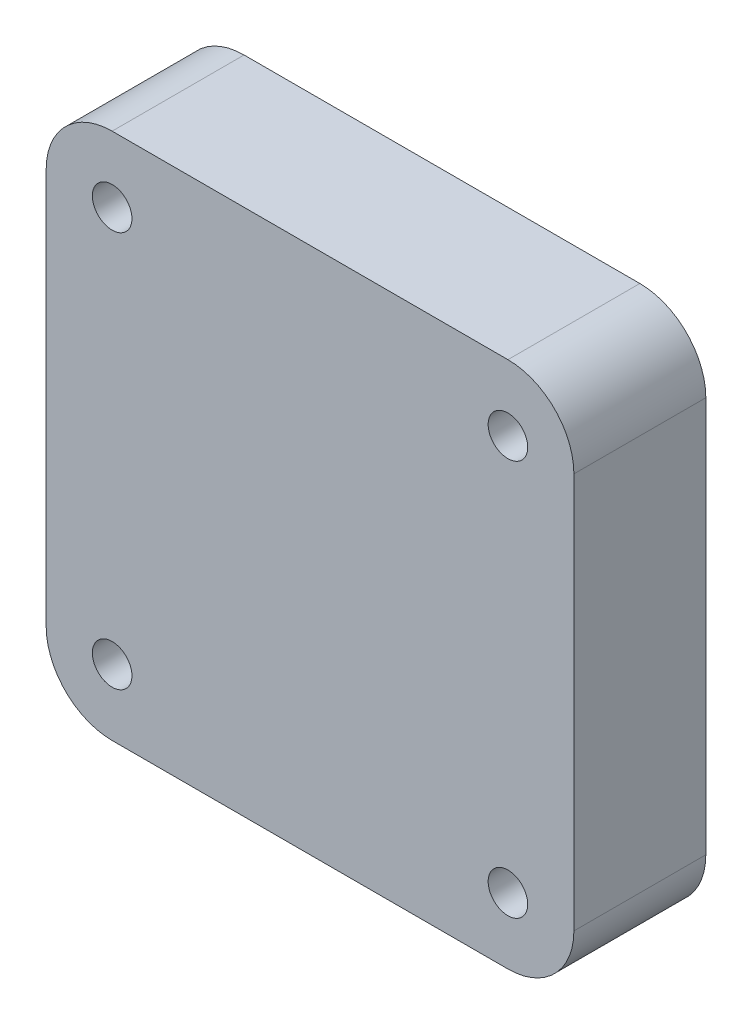
ISO-10303-21;
HEADER;
FILE_DESCRIPTION(('STEP AP214'),'2;1');
FILE_NAME('part.step','',(''),(''),'','','');
FILE_SCHEMA(('AUTOMOTIVE_DESIGN { 1 0 10303 214 1 1 1 1 }'));
ENDSEC;
DATA;
#1=APPLICATION_CONTEXT('core data for automotive mechanical design processes');
#2=APPLICATION_PROTOCOL_DEFINITION('international standard','automotive_design',2000,#1);
#3=PRODUCT_CONTEXT('',#1,'mechanical');
#4=PRODUCT('Part','Part','',(#3));
#5=PRODUCT_RELATED_PRODUCT_CATEGORY('part','',(#4));
#6=PRODUCT_DEFINITION_FORMATION('','',#4);
#7=PRODUCT_DEFINITION_CONTEXT('part definition',#1,'design');
#8=PRODUCT_DEFINITION('design','',#6,#7);
#9=PRODUCT_DEFINITION_SHAPE('','',#8);
#10=(LENGTH_UNIT() NAMED_UNIT(*) SI_UNIT(.MILLI.,.METRE.));
#11=(NAMED_UNIT(*) PLANE_ANGLE_UNIT() SI_UNIT($,.RADIAN.));
#12=(NAMED_UNIT(*) SI_UNIT($,.STERADIAN.) SOLID_ANGLE_UNIT());
#13=UNCERTAINTY_MEASURE_WITH_UNIT(LENGTH_MEASURE(1.E-05),#10,'distance_accuracy_value','');
#14=(GEOMETRIC_REPRESENTATION_CONTEXT(3) GLOBAL_UNCERTAINTY_ASSIGNED_CONTEXT((#13)) GLOBAL_UNIT_ASSIGNED_CONTEXT((#10,
#11,#12)) REPRESENTATION_CONTEXT('',''));
#15=CARTESIAN_POINT('',(0.,0.,0.));
#16=DIRECTION('',(0.,0.,1.));
#17=DIRECTION('',(1.,0.,0.));
#18=AXIS2_PLACEMENT_3D('',#15,#16,#17);
#19=CARTESIAN_POINT('',(0.,0.,10.));
#20=DIRECTION('',(0.,0.,1.));
#21=DIRECTION('',(1.,0.,0.));
#22=AXIS2_PLACEMENT_3D('',#19,#20,#21);
#23=PLANE('',#22);
#24=CARTESIAN_POINT('',(-15.,-15.,10.));
#25=DIRECTION('',(0.,0.,1.));
#26=DIRECTION('',(1.,0.,0.));
#27=AXIS2_PLACEMENT_3D('',#24,#25,#26);
#28=CIRCLE('',#27,1.5);
#29=CARTESIAN_POINT('',(-13.5,-15.,10.));
#30=VERTEX_POINT('',#29);
#31=EDGE_CURVE('E186',#30,#30,#28,.T.);
#32=ORIENTED_EDGE('',*,*,#31,.F.);
#33=EDGE_LOOP('',(#32));
#34=FACE_BOUND('',#33,.T.);
#35=CARTESIAN_POINT('',(-15.,15.,10.));
#36=DIRECTION('',(0.,0.,1.));
#37=DIRECTION('',(1.,0.,0.));
#38=AXIS2_PLACEMENT_3D('',#35,#36,#37);
#39=CIRCLE('',#38,1.5);
#40=CARTESIAN_POINT('',(-13.5,15.,10.));
#41=VERTEX_POINT('',#40);
#42=EDGE_CURVE('E169',#41,#41,#39,.T.);
#43=ORIENTED_EDGE('',*,*,#42,.F.);
#44=EDGE_LOOP('',(#43));
#45=FACE_BOUND('',#44,.T.);
#46=DIRECTION('',(0.,-1.,0.));
#47=VECTOR('',#46,1.);
#48=CARTESIAN_POINT('',(-20.,20.,10.));
#49=LINE('',#48,#47);
#50=CARTESIAN_POINT('',(-20.,15.,10.));
#51=VERTEX_POINT('',#50);
#52=CARTESIAN_POINT('',(-20.,-15.,10.));
#53=VERTEX_POINT('',#52);
#54=EDGE_CURVE('E176',#51,#53,#49,.T.);
#55=ORIENTED_EDGE('',*,*,#54,.T.);
#56=CARTESIAN_POINT('',(-15.,-15.,10.));
#57=DIRECTION('',(0.,0.,1.));
#58=DIRECTION('',(1.,0.,0.));
#59=AXIS2_PLACEMENT_3D('',#56,#57,#58);
#60=CIRCLE('',#59,5.);
#61=CARTESIAN_POINT('',(-15.,-20.,10.));
#62=VERTEX_POINT('',#61);
#63=EDGE_CURVE('E153',#53,#62,#60,.T.);
#64=ORIENTED_EDGE('',*,*,#63,.T.);
#65=DIRECTION('',(1.,0.,0.));
#66=VECTOR('',#65,1.);
#67=CARTESIAN_POINT('',(-20.,-20.,10.));
#68=LINE('',#67,#66);
#69=CARTESIAN_POINT('',(15.,-20.,10.));
#70=VERTEX_POINT('',#69);
#71=EDGE_CURVE('E124',#62,#70,#68,.T.);
#72=ORIENTED_EDGE('',*,*,#71,.T.);
#73=CARTESIAN_POINT('',(15.,-15.,10.));
#74=DIRECTION('',(0.,0.,1.));
#75=DIRECTION('',(1.,0.,0.));
#76=AXIS2_PLACEMENT_3D('',#73,#74,#75);
#77=CIRCLE('',#76,5.);
#78=CARTESIAN_POINT('',(20.,-15.,10.));
#79=VERTEX_POINT('',#78);
#80=EDGE_CURVE('E151',#70,#79,#77,.T.);
#81=ORIENTED_EDGE('',*,*,#80,.T.);
#82=DIRECTION('',(0.,1.,0.));
#83=VECTOR('',#82,1.);
#84=CARTESIAN_POINT('',(20.,20.,10.));
#85=LINE('',#84,#83);
#86=CARTESIAN_POINT('',(20.,15.,10.));
#87=VERTEX_POINT('',#86);
#88=EDGE_CURVE('E131',#79,#87,#85,.T.);
#89=ORIENTED_EDGE('',*,*,#88,.T.);
#90=CARTESIAN_POINT('',(15.,15.,10.));
#91=DIRECTION('',(0.,0.,1.));
#92=DIRECTION('',(1.,0.,0.));
#93=AXIS2_PLACEMENT_3D('',#90,#91,#92);
#94=CIRCLE('',#93,5.);
#95=CARTESIAN_POINT('',(15.,20.,10.));
#96=VERTEX_POINT('',#95);
#97=EDGE_CURVE('E59',#87,#96,#94,.T.);
#98=ORIENTED_EDGE('',*,*,#97,.T.);
#99=DIRECTION('',(-1.,0.,0.));
#100=VECTOR('',#99,1.);
#101=CARTESIAN_POINT('',(-20.,20.,10.));
#102=LINE('',#101,#100);
#103=CARTESIAN_POINT('',(-15.,20.,10.));
#104=VERTEX_POINT('',#103);
#105=EDGE_CURVE('E134',#96,#104,#102,.T.);
#106=ORIENTED_EDGE('',*,*,#105,.T.);
#107=CARTESIAN_POINT('',(-15.,15.,10.));
#108=DIRECTION('',(0.,0.,1.));
#109=DIRECTION('',(1.,0.,0.));
#110=AXIS2_PLACEMENT_3D('',#107,#108,#109);
#111=CIRCLE('',#110,5.);
#112=EDGE_CURVE('E148',#104,#51,#111,.T.);
#113=ORIENTED_EDGE('',*,*,#112,.T.);
#114=EDGE_LOOP('',(#55,#64,#72,#81,#89,#98,#106,#113));
#115=FACE_BOUND('',#114,.T.);
#116=CARTESIAN_POINT('',(15.,15.,10.));
#117=DIRECTION('',(0.,0.,1.));
#118=DIRECTION('',(1.,0.,0.));
#119=AXIS2_PLACEMENT_3D('',#116,#117,#118);
#120=CIRCLE('',#119,1.5);
#121=CARTESIAN_POINT('',(16.5,15.,10.));
#122=VERTEX_POINT('',#121);
#123=EDGE_CURVE('E181',#122,#122,#120,.T.);
#124=ORIENTED_EDGE('',*,*,#123,.F.);
#125=EDGE_LOOP('',(#124));
#126=FACE_BOUND('',#125,.T.);
#127=CARTESIAN_POINT('',(15.,-15.,10.));
#128=DIRECTION('',(0.,0.,1.));
#129=DIRECTION('',(1.,0.,0.));
#130=AXIS2_PLACEMENT_3D('',#127,#128,#129);
#131=CIRCLE('',#130,1.5);
#132=CARTESIAN_POINT('',(16.5,-15.,10.));
#133=VERTEX_POINT('',#132);
#134=EDGE_CURVE('E192',#133,#133,#131,.T.);
#135=ORIENTED_EDGE('',*,*,#134,.F.);
#136=EDGE_LOOP('',(#135));
#137=FACE_BOUND('',#136,.T.);
#138=ADVANCED_FACE('F38',(#34,#45,#115,#126,#137),#23,.T.);
#139=CARTESIAN_POINT('',(0.,0.,0.));
#140=DIRECTION('',(0.,0.,1.));
#141=DIRECTION('',(1.,0.,0.));
#142=AXIS2_PLACEMENT_3D('',#139,#140,#141);
#143=PLANE('',#142);
#144=DIRECTION('',(1.,0.,0.));
#145=VECTOR('',#144,1.);
#146=CARTESIAN_POINT('',(-20.,-20.,0.));
#147=LINE('',#146,#145);
#148=CARTESIAN_POINT('',(-15.,-20.,0.));
#149=VERTEX_POINT('',#148);
#150=CARTESIAN_POINT('',(15.,-20.,0.));
#151=VERTEX_POINT('',#150);
#152=EDGE_CURVE('E121',#149,#151,#147,.T.);
#153=ORIENTED_EDGE('',*,*,#152,.F.);
#154=CARTESIAN_POINT('',(-15.,-15.,0.));
#155=DIRECTION('',(0.,0.,1.));
#156=DIRECTION('',(1.,0.,0.));
#157=AXIS2_PLACEMENT_3D('',#154,#155,#156);
#158=CIRCLE('',#157,5.);
#159=CARTESIAN_POINT('',(-20.,-15.,0.));
#160=VERTEX_POINT('',#159);
#161=EDGE_CURVE('E104',#149,#160,#158,.F.);
#162=ORIENTED_EDGE('',*,*,#161,.T.);
#163=DIRECTION('',(0.,-1.,0.));
#164=VECTOR('',#163,1.);
#165=CARTESIAN_POINT('',(-20.,20.,0.));
#166=LINE('',#165,#164);
#167=CARTESIAN_POINT('',(-20.,15.,0.));
#168=VERTEX_POINT('',#167);
#169=EDGE_CURVE('E132',#168,#160,#166,.T.);
#170=ORIENTED_EDGE('',*,*,#169,.F.);
#171=CARTESIAN_POINT('',(-15.,15.,0.));
#172=DIRECTION('',(0.,0.,1.));
#173=DIRECTION('',(1.,0.,0.));
#174=AXIS2_PLACEMENT_3D('',#171,#172,#173);
#175=CIRCLE('',#174,5.);
#176=CARTESIAN_POINT('',(-15.,20.,0.));
#177=VERTEX_POINT('',#176);
#178=EDGE_CURVE('E125',#168,#177,#175,.F.);
#179=ORIENTED_EDGE('',*,*,#178,.T.);
#180=DIRECTION('',(-1.,0.,0.));
#181=VECTOR('',#180,1.);
#182=CARTESIAN_POINT('',(-20.,20.,0.));
#183=LINE('',#182,#181);
#184=CARTESIAN_POINT('',(15.,20.,0.));
#185=VERTEX_POINT('',#184);
#186=EDGE_CURVE('E136',#185,#177,#183,.T.);
#187=ORIENTED_EDGE('',*,*,#186,.F.);
#188=CARTESIAN_POINT('',(15.,15.,0.));
#189=DIRECTION('',(0.,0.,1.));
#190=DIRECTION('',(1.,0.,0.));
#191=AXIS2_PLACEMENT_3D('',#188,#189,#190);
#192=CIRCLE('',#191,5.);
#193=CARTESIAN_POINT('',(20.,15.,0.));
#194=VERTEX_POINT('',#193);
#195=EDGE_CURVE('E142',#185,#194,#192,.F.);
#196=ORIENTED_EDGE('',*,*,#195,.T.);
#197=DIRECTION('',(0.,1.,0.));
#198=VECTOR('',#197,1.);
#199=CARTESIAN_POINT('',(20.,20.,0.));
#200=LINE('',#199,#198);
#201=CARTESIAN_POINT('',(20.,-15.,0.));
#202=VERTEX_POINT('',#201);
#203=EDGE_CURVE('E164',#202,#194,#200,.T.);
#204=ORIENTED_EDGE('',*,*,#203,.F.);
#205=CARTESIAN_POINT('',(15.,-15.,0.));
#206=DIRECTION('',(0.,0.,1.));
#207=DIRECTION('',(1.,0.,0.));
#208=AXIS2_PLACEMENT_3D('',#205,#206,#207);
#209=CIRCLE('',#208,5.);
#210=EDGE_CURVE('E115',#202,#151,#209,.F.);
#211=ORIENTED_EDGE('',*,*,#210,.T.);
#212=EDGE_LOOP('',(#153,#162,#170,#179,#187,#196,#204,#211));
#213=FACE_BOUND('',#212,.T.);
#214=CARTESIAN_POINT('',(-15.,15.,0.));
#215=DIRECTION('',(0.,0.,1.));
#216=DIRECTION('',(1.,0.,0.));
#217=AXIS2_PLACEMENT_3D('',#214,#215,#216);
#218=CIRCLE('',#217,1.5);
#219=CARTESIAN_POINT('',(-13.5,15.,0.));
#220=VERTEX_POINT('',#219);
#221=EDGE_CURVE('E172',#220,#220,#218,.T.);
#222=ORIENTED_EDGE('',*,*,#221,.T.);
#223=EDGE_LOOP('',(#222));
#224=FACE_BOUND('',#223,.T.);
#225=CARTESIAN_POINT('',(15.,15.,0.));
#226=DIRECTION('',(0.,0.,1.));
#227=DIRECTION('',(1.,0.,0.));
#228=AXIS2_PLACEMENT_3D('',#225,#226,#227);
#229=CIRCLE('',#228,1.5);
#230=CARTESIAN_POINT('',(16.5,15.,0.));
#231=VERTEX_POINT('',#230);
#232=EDGE_CURVE('E183',#231,#231,#229,.T.);
#233=ORIENTED_EDGE('',*,*,#232,.T.);
#234=EDGE_LOOP('',(#233));
#235=FACE_BOUND('',#234,.T.);
#236=CARTESIAN_POINT('',(-15.,-15.,0.));
#237=DIRECTION('',(0.,0.,1.));
#238=DIRECTION('',(1.,0.,0.));
#239=AXIS2_PLACEMENT_3D('',#236,#237,#238);
#240=CIRCLE('',#239,1.5);
#241=CARTESIAN_POINT('',(-13.5,-15.,0.));
#242=VERTEX_POINT('',#241);
#243=EDGE_CURVE('E189',#242,#242,#240,.T.);
#244=ORIENTED_EDGE('',*,*,#243,.T.);
#245=EDGE_LOOP('',(#244));
#246=FACE_BOUND('',#245,.T.);
#247=CARTESIAN_POINT('',(15.,-15.,0.));
#248=DIRECTION('',(0.,0.,1.));
#249=DIRECTION('',(1.,0.,0.));
#250=AXIS2_PLACEMENT_3D('',#247,#248,#249);
#251=CIRCLE('',#250,1.5);
#252=CARTESIAN_POINT('',(16.5,-15.,0.));
#253=VERTEX_POINT('',#252);
#254=EDGE_CURVE('E195',#253,#253,#251,.T.);
#255=ORIENTED_EDGE('',*,*,#254,.T.);
#256=EDGE_LOOP('',(#255));
#257=FACE_BOUND('',#256,.T.);
#258=ADVANCED_FACE('F128',(#213,#224,#235,#246,#257),#143,.F.);
#259=CARTESIAN_POINT('',(20.,20.,10.));
#260=DIRECTION('',(-1.,0.,0.));
#261=DIRECTION('',(0.,-1.,0.));
#262=AXIS2_PLACEMENT_3D('',#259,#260,#261);
#263=PLANE('',#262);
#264=ORIENTED_EDGE('',*,*,#88,.F.);
#265=DIRECTION('',(0.,0.,-1.));
#266=VECTOR('',#265,1.);
#267=CARTESIAN_POINT('',(20.,-15.,10.));
#268=LINE('',#267,#266);
#269=EDGE_CURVE('E157',#79,#202,#268,.T.);
#270=ORIENTED_EDGE('',*,*,#269,.T.);
#271=ORIENTED_EDGE('',*,*,#203,.T.);
#272=DIRECTION('',(0.,0.,-1.));
#273=VECTOR('',#272,1.);
#274=CARTESIAN_POINT('',(20.,15.,10.));
#275=LINE('',#274,#273);
#276=EDGE_CURVE('E155',#194,#87,#275,.F.);
#277=ORIENTED_EDGE('',*,*,#276,.T.);
#278=EDGE_LOOP('',(#264,#270,#271,#277));
#279=FACE_BOUND('',#278,.T.);
#280=ADVANCED_FACE('F163',(#279),#263,.F.);
#281=CARTESIAN_POINT('',(-20.,20.,10.));
#282=DIRECTION('',(0.,-1.,0.));
#283=DIRECTION('',(0.,0.,-1.));
#284=AXIS2_PLACEMENT_3D('',#281,#282,#283);
#285=PLANE('',#284);
#286=ORIENTED_EDGE('',*,*,#105,.F.);
#287=DIRECTION('',(0.,0.,-1.));
#288=VECTOR('',#287,1.);
#289=CARTESIAN_POINT('',(15.,20.,10.));
#290=LINE('',#289,#288);
#291=EDGE_CURVE('E11',#96,#185,#290,.T.);
#292=ORIENTED_EDGE('',*,*,#291,.T.);
#293=ORIENTED_EDGE('',*,*,#186,.T.);
#294=DIRECTION('',(0.,0.,-1.));
#295=VECTOR('',#294,1.);
#296=CARTESIAN_POINT('',(-15.,20.,10.));
#297=LINE('',#296,#295);
#298=EDGE_CURVE('E46',#177,#104,#297,.F.);
#299=ORIENTED_EDGE('',*,*,#298,.T.);
#300=EDGE_LOOP('',(#286,#292,#293,#299));
#301=FACE_BOUND('',#300,.T.);
#302=ADVANCED_FACE('F222',(#301),#285,.F.);
#303=CARTESIAN_POINT('',(-20.,20.,10.));
#304=DIRECTION('',(1.,0.,0.));
#305=DIRECTION('',(0.,0.,-1.));
#306=AXIS2_PLACEMENT_3D('',#303,#304,#305);
#307=PLANE('',#306);
#308=ORIENTED_EDGE('',*,*,#169,.T.);
#309=DIRECTION('',(0.,0.,-1.));
#310=VECTOR('',#309,1.);
#311=CARTESIAN_POINT('',(-20.,-15.,10.));
#312=LINE('',#311,#310);
#313=EDGE_CURVE('E109',#160,#53,#312,.F.);
#314=ORIENTED_EDGE('',*,*,#313,.T.);
#315=ORIENTED_EDGE('',*,*,#54,.F.);
#316=DIRECTION('',(0.,0.,-1.));
#317=VECTOR('',#316,1.);
#318=CARTESIAN_POINT('',(-20.,15.,10.));
#319=LINE('',#318,#317);
#320=EDGE_CURVE('E114',#51,#168,#319,.T.);
#321=ORIENTED_EDGE('',*,*,#320,.T.);
#322=EDGE_LOOP('',(#308,#314,#315,#321));
#323=FACE_BOUND('',#322,.T.);
#324=ADVANCED_FACE('F219',(#323),#307,.F.);
#325=CARTESIAN_POINT('',(-20.,-20.,10.));
#326=DIRECTION('',(0.,1.,0.));
#327=DIRECTION('',(0.,0.,1.));
#328=AXIS2_PLACEMENT_3D('',#325,#326,#327);
#329=PLANE('',#328);
#330=ORIENTED_EDGE('',*,*,#71,.F.);
#331=DIRECTION('',(0.,0.,-1.));
#332=VECTOR('',#331,1.);
#333=CARTESIAN_POINT('',(-15.,-20.,10.));
#334=LINE('',#333,#332);
#335=EDGE_CURVE('E108',#62,#149,#334,.T.);
#336=ORIENTED_EDGE('',*,*,#335,.T.);
#337=ORIENTED_EDGE('',*,*,#152,.T.);
#338=DIRECTION('',(0.,0.,-1.));
#339=VECTOR('',#338,1.);
#340=CARTESIAN_POINT('',(15.,-20.,10.));
#341=LINE('',#340,#339);
#342=EDGE_CURVE('E126',#151,#70,#341,.F.);
#343=ORIENTED_EDGE('',*,*,#342,.T.);
#344=EDGE_LOOP('',(#330,#336,#337,#343));
#345=FACE_BOUND('',#344,.T.);
#346=ADVANCED_FACE('F120',(#345),#329,.F.);
#347=CARTESIAN_POINT('',(-15.,15.,10.));
#348=DIRECTION('',(0.,0.,-1.));
#349=DIRECTION('',(-1.,0.,0.));
#350=AXIS2_PLACEMENT_3D('',#347,#348,#349);
#351=CYLINDRICAL_SURFACE('',#350,1.5);
#352=ORIENTED_EDGE('',*,*,#42,.T.);
#353=EDGE_LOOP('',(#352));
#354=FACE_BOUND('',#353,.T.);
#355=ORIENTED_EDGE('',*,*,#221,.F.);
#356=EDGE_LOOP('',(#355));
#357=FACE_BOUND('',#356,.T.);
#358=ADVANCED_FACE('F214',(#354,#357),#351,.F.);
#359=CARTESIAN_POINT('',(15.,15.,10.));
#360=DIRECTION('',(0.,0.,-1.));
#361=DIRECTION('',(-1.,0.,0.));
#362=AXIS2_PLACEMENT_3D('',#359,#360,#361);
#363=CYLINDRICAL_SURFACE('',#362,1.5);
#364=ORIENTED_EDGE('',*,*,#123,.T.);
#365=EDGE_LOOP('',(#364));
#366=FACE_BOUND('',#365,.T.);
#367=ORIENTED_EDGE('',*,*,#232,.F.);
#368=EDGE_LOOP('',(#367));
#369=FACE_BOUND('',#368,.T.);
#370=ADVANCED_FACE('F246',(#366,#369),#363,.F.);
#371=CARTESIAN_POINT('',(-15.,-15.,10.));
#372=DIRECTION('',(0.,0.,-1.));
#373=DIRECTION('',(-1.,0.,0.));
#374=AXIS2_PLACEMENT_3D('',#371,#372,#373);
#375=CYLINDRICAL_SURFACE('',#374,1.5);
#376=ORIENTED_EDGE('',*,*,#31,.T.);
#377=EDGE_LOOP('',(#376));
#378=FACE_BOUND('',#377,.T.);
#379=ORIENTED_EDGE('',*,*,#243,.F.);
#380=EDGE_LOOP('',(#379));
#381=FACE_BOUND('',#380,.T.);
#382=ADVANCED_FACE('F249',(#378,#381),#375,.F.);
#383=CARTESIAN_POINT('',(15.,-15.,10.));
#384=DIRECTION('',(0.,0.,-1.));
#385=DIRECTION('',(-1.,0.,0.));
#386=AXIS2_PLACEMENT_3D('',#383,#384,#385);
#387=CYLINDRICAL_SURFACE('',#386,1.5);
#388=ORIENTED_EDGE('',*,*,#134,.T.);
#389=EDGE_LOOP('',(#388));
#390=FACE_BOUND('',#389,.T.);
#391=ORIENTED_EDGE('',*,*,#254,.F.);
#392=EDGE_LOOP('',(#391));
#393=FACE_BOUND('',#392,.T.);
#394=ADVANCED_FACE('F201',(#390,#393),#387,.F.);
#395=CARTESIAN_POINT('',(-15.,-15.,10.));
#396=DIRECTION('',(0.,0.,-1.));
#397=DIRECTION('',(-1.,0.,0.));
#398=AXIS2_PLACEMENT_3D('',#395,#396,#397);
#399=CYLINDRICAL_SURFACE('',#398,5.);
#400=ORIENTED_EDGE('',*,*,#63,.F.);
#401=ORIENTED_EDGE('',*,*,#313,.F.);
#402=ORIENTED_EDGE('',*,*,#161,.F.);
#403=ORIENTED_EDGE('',*,*,#335,.F.);
#404=EDGE_LOOP('',(#400,#401,#402,#403));
#405=FACE_BOUND('',#404,.T.);
#406=ADVANCED_FACE('F107',(#405),#399,.T.);
#407=CARTESIAN_POINT('',(15.,-15.,10.));
#408=DIRECTION('',(0.,0.,-1.));
#409=DIRECTION('',(-1.,0.,0.));
#410=AXIS2_PLACEMENT_3D('',#407,#408,#409);
#411=CYLINDRICAL_SURFACE('',#410,5.);
#412=ORIENTED_EDGE('',*,*,#80,.F.);
#413=ORIENTED_EDGE('',*,*,#342,.F.);
#414=ORIENTED_EDGE('',*,*,#210,.F.);
#415=ORIENTED_EDGE('',*,*,#269,.F.);
#416=EDGE_LOOP('',(#412,#413,#414,#415));
#417=FACE_BOUND('',#416,.T.);
#418=ADVANCED_FACE('F230',(#417),#411,.T.);
#419=CARTESIAN_POINT('',(15.,15.,10.));
#420=DIRECTION('',(0.,0.,-1.));
#421=DIRECTION('',(-1.,0.,0.));
#422=AXIS2_PLACEMENT_3D('',#419,#420,#421);
#423=CYLINDRICAL_SURFACE('',#422,5.);
#424=ORIENTED_EDGE('',*,*,#97,.F.);
#425=ORIENTED_EDGE('',*,*,#276,.F.);
#426=ORIENTED_EDGE('',*,*,#195,.F.);
#427=ORIENTED_EDGE('',*,*,#291,.F.);
#428=EDGE_LOOP('',(#424,#425,#426,#427));
#429=FACE_BOUND('',#428,.T.);
#430=ADVANCED_FACE('F232',(#429),#423,.T.);
#431=CARTESIAN_POINT('',(-15.,15.,10.));
#432=DIRECTION('',(0.,0.,-1.));
#433=DIRECTION('',(-1.,0.,0.));
#434=AXIS2_PLACEMENT_3D('',#431,#432,#433);
#435=CYLINDRICAL_SURFACE('',#434,5.);
#436=ORIENTED_EDGE('',*,*,#112,.F.);
#437=ORIENTED_EDGE('',*,*,#298,.F.);
#438=ORIENTED_EDGE('',*,*,#178,.F.);
#439=ORIENTED_EDGE('',*,*,#320,.F.);
#440=EDGE_LOOP('',(#436,#437,#438,#439));
#441=FACE_BOUND('',#440,.T.);
#442=ADVANCED_FACE('F40',(#441),#435,.T.);
#443=CLOSED_SHELL('',(#138,#258,#280,#302,#324,#346,#358,#370,#382,#394,#406,#418,#430,#442));
#444=MANIFOLD_SOLID_BREP('B2',#443);
#445=ADVANCED_BREP_SHAPE_REPRESENTATION('',(#18,#444),#14);
#446=SHAPE_DEFINITION_REPRESENTATION(#9,#445);
ENDSEC;
END-ISO-10303-21;
